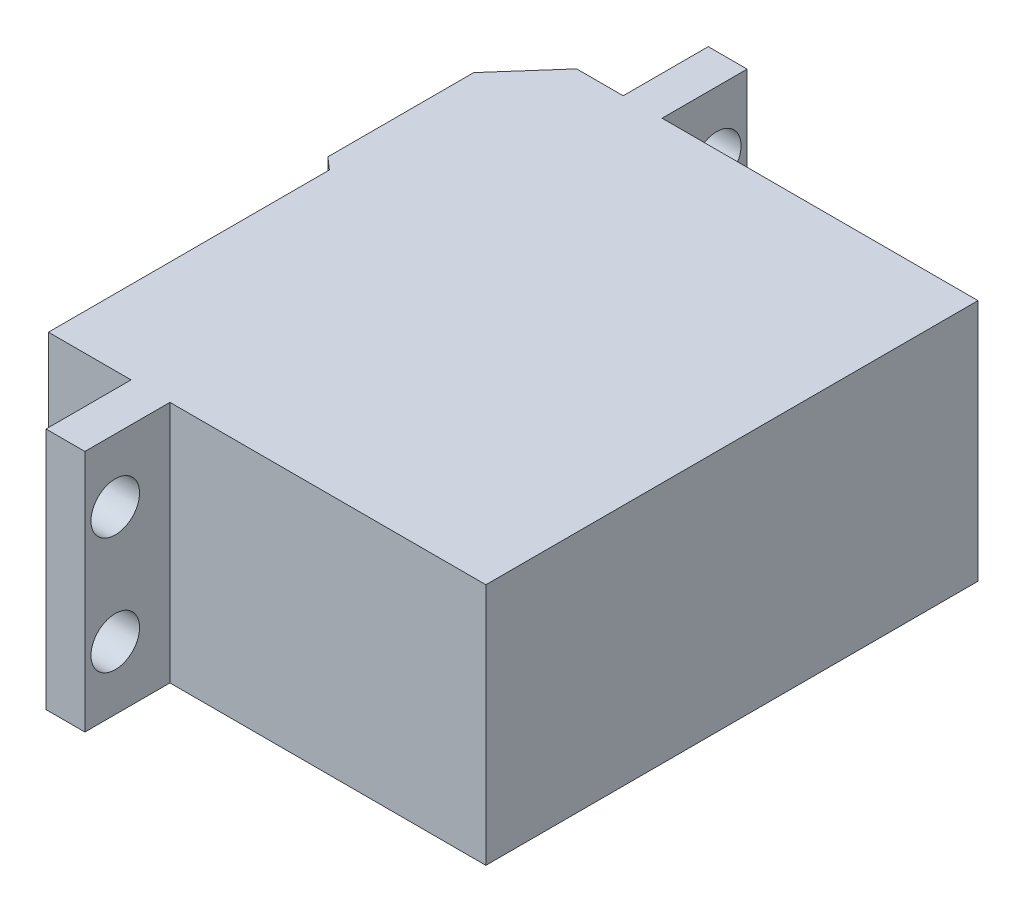
ISO-10303-21;
HEADER;
FILE_DESCRIPTION(('STEP AP214'),'2;1');
FILE_NAME('part.step','',(''),(''),'','','');
FILE_SCHEMA(('AUTOMOTIVE_DESIGN { 1 0 10303 214 1 1 1 1 }'));
ENDSEC;
DATA;
#1=APPLICATION_CONTEXT('core data for automotive mechanical design processes');
#2=APPLICATION_PROTOCOL_DEFINITION('international standard','automotive_design',2000,#1);
#3=PRODUCT_CONTEXT('',#1,'mechanical');
#4=PRODUCT('Part','Part','',(#3));
#5=PRODUCT_RELATED_PRODUCT_CATEGORY('part','',(#4));
#6=PRODUCT_DEFINITION_FORMATION('','',#4);
#7=PRODUCT_DEFINITION_CONTEXT('part definition',#1,'design');
#8=PRODUCT_DEFINITION('design','',#6,#7);
#9=PRODUCT_DEFINITION_SHAPE('','',#8);
#10=(LENGTH_UNIT() NAMED_UNIT(*) SI_UNIT(.MILLI.,.METRE.));
#11=(NAMED_UNIT(*) PLANE_ANGLE_UNIT() SI_UNIT($,.RADIAN.));
#12=(NAMED_UNIT(*) SI_UNIT($,.STERADIAN.) SOLID_ANGLE_UNIT());
#13=UNCERTAINTY_MEASURE_WITH_UNIT(LENGTH_MEASURE(1.E-05),#10,'distance_accuracy_value','');
#14=(GEOMETRIC_REPRESENTATION_CONTEXT(3) GLOBAL_UNCERTAINTY_ASSIGNED_CONTEXT((#13)) GLOBAL_UNIT_ASSIGNED_CONTEXT((#10,
#11,#12)) REPRESENTATION_CONTEXT('',''));
#15=CARTESIAN_POINT('',(0.,0.,0.));
#16=DIRECTION('',(0.,0.,1.));
#17=DIRECTION('',(1.,0.,0.));
#18=AXIS2_PLACEMENT_3D('',#15,#16,#17);
#19=CARTESIAN_POINT('',(-37.,20.,-36.));
#20=DIRECTION('',(1.,0.,0.));
#21=DIRECTION('',(0.,0.,-1.));
#22=AXIS2_PLACEMENT_3D('',#19,#20,#21);
#23=PLANE('',#22);
#24=DIRECTION('',(0.,0.,1.));
#25=VECTOR('',#24,1.);
#26=CARTESIAN_POINT('',(-37.,0.,-36.));
#27=LINE('',#26,#25);
#28=CARTESIAN_POINT('',(-37.,0.,-36.));
#29=VERTEX_POINT('',#28);
#30=CARTESIAN_POINT('',(-37.,0.,-24.));
#31=VERTEX_POINT('',#30);
#32=EDGE_CURVE('E287',#29,#31,#27,.T.);
#33=ORIENTED_EDGE('',*,*,#32,.T.);
#34=DIRECTION('',(0.,-1.,0.));
#35=VECTOR('',#34,1.);
#36=CARTESIAN_POINT('',(-37.,20.,-24.));
#37=LINE('',#36,#35);
#38=CARTESIAN_POINT('',(-37.,20.,-24.));
#39=VERTEX_POINT('',#38);
#40=EDGE_CURVE('E330',#39,#31,#37,.T.);
#41=ORIENTED_EDGE('',*,*,#40,.F.);
#42=DIRECTION('',(0.,0.,1.));
#43=VECTOR('',#42,1.);
#44=CARTESIAN_POINT('',(-37.,20.,-36.));
#45=LINE('',#44,#43);
#46=CARTESIAN_POINT('',(-37.,20.,-36.));
#47=VERTEX_POINT('',#46);
#48=EDGE_CURVE('E245',#47,#39,#45,.T.);
#49=ORIENTED_EDGE('',*,*,#48,.F.);
#50=DIRECTION('',(0.,-1.,0.));
#51=VECTOR('',#50,1.);
#52=CARTESIAN_POINT('',(-37.,20.,-36.));
#53=LINE('',#52,#51);
#54=EDGE_CURVE('E334',#47,#29,#53,.T.);
#55=ORIENTED_EDGE('',*,*,#54,.T.);
#56=EDGE_LOOP('',(#33,#41,#49,#55));
#57=FACE_BOUND('',#56,.T.);
#58=DIRECTION('',(0.,-0.866025403784439,-0.499999999999999));
#59=VECTOR('',#58,1.);
#60=CARTESIAN_POINT('',(-37.,13.,-31.7320508075689));
#61=LINE('',#60,#59);
#62=CARTESIAN_POINT('',(-37.,13.,-31.7320508075689));
#63=VERTEX_POINT('',#62);
#64=CARTESIAN_POINT('',(-37.,10.,-33.4641016151377));
#65=VERTEX_POINT('',#64);
#66=EDGE_CURVE('E57',#63,#65,#61,.T.);
#67=ORIENTED_EDGE('',*,*,#66,.F.);
#68=DIRECTION('',(0.,0.,-1.));
#69=VECTOR('',#68,1.);
#70=CARTESIAN_POINT('',(-37.,13.,-28.2679491924311));
#71=LINE('',#70,#69);
#72=CARTESIAN_POINT('',(-37.,13.,-28.2679491924311));
#73=VERTEX_POINT('',#72);
#74=EDGE_CURVE('E61',#73,#63,#71,.T.);
#75=ORIENTED_EDGE('',*,*,#74,.F.);
#76=DIRECTION('',(0.,0.866025403784439,-0.5));
#77=VECTOR('',#76,1.);
#78=CARTESIAN_POINT('',(-37.,10.,-26.5358983848622));
#79=LINE('',#78,#77);
#80=CARTESIAN_POINT('',(-37.,10.,-26.5358983848622));
#81=VERTEX_POINT('',#80);
#82=EDGE_CURVE('E414',#81,#73,#79,.T.);
#83=ORIENTED_EDGE('',*,*,#82,.F.);
#84=DIRECTION('',(0.,0.866025403784438,0.5));
#85=VECTOR('',#84,1.);
#86=CARTESIAN_POINT('',(-37.,7.,-28.2679491924311));
#87=LINE('',#86,#85);
#88=CARTESIAN_POINT('',(-37.,7.,-28.2679491924311));
#89=VERTEX_POINT('',#88);
#90=EDGE_CURVE('E410',#89,#81,#87,.T.);
#91=ORIENTED_EDGE('',*,*,#90,.F.);
#92=DIRECTION('',(0.,0.,1.));
#93=VECTOR('',#92,1.);
#94=CARTESIAN_POINT('',(-37.,7.,-31.7320508075689));
#95=LINE('',#94,#93);
#96=CARTESIAN_POINT('',(-37.,7.,-31.7320508075689));
#97=VERTEX_POINT('',#96);
#98=EDGE_CURVE('E406',#97,#89,#95,.T.);
#99=ORIENTED_EDGE('',*,*,#98,.F.);
#100=DIRECTION('',(0.,-0.866025403784439,0.5));
#101=VECTOR('',#100,1.);
#102=CARTESIAN_POINT('',(-37.,10.,-33.4641016151377));
#103=LINE('',#102,#101);
#104=EDGE_CURVE('E403',#65,#97,#103,.T.);
#105=ORIENTED_EDGE('',*,*,#104,.F.);
#106=EDGE_LOOP('',(#67,#75,#83,#91,#99,#105));
#107=FACE_BOUND('',#106,.T.);
#108=ADVANCED_FACE('F39',(#57,#107),#23,.F.);
#109=CARTESIAN_POINT('',(-26.,20.,0.));
#110=DIRECTION('',(0.,0.,-1.));
#111=DIRECTION('',(-1.,0.,0.));
#112=AXIS2_PLACEMENT_3D('',#109,#110,#111);
#113=PLANE('',#112);
#114=DIRECTION('',(1.,0.,0.));
#115=VECTOR('',#114,1.);
#116=CARTESIAN_POINT('',(-26.,0.,0.));
#117=LINE('',#116,#115);
#118=CARTESIAN_POINT('',(-26.,0.,0.));
#119=VERTEX_POINT('',#118);
#120=CARTESIAN_POINT('',(0.,0.,0.));
#121=VERTEX_POINT('',#120);
#122=EDGE_CURVE('E208',#119,#121,#117,.T.);
#123=ORIENTED_EDGE('',*,*,#122,.T.);
#124=DIRECTION('',(0.,-1.,0.));
#125=VECTOR('',#124,1.);
#126=CARTESIAN_POINT('',(0.,20.,0.));
#127=LINE('',#126,#125);
#128=CARTESIAN_POINT('',(0.,20.,0.));
#129=VERTEX_POINT('',#128);
#130=EDGE_CURVE('E11',#129,#121,#127,.T.);
#131=ORIENTED_EDGE('',*,*,#130,.F.);
#132=DIRECTION('',(1.,0.,0.));
#133=VECTOR('',#132,1.);
#134=CARTESIAN_POINT('',(-26.,20.,0.));
#135=LINE('',#134,#133);
#136=CARTESIAN_POINT('',(-26.,20.,0.));
#137=VERTEX_POINT('',#136);
#138=EDGE_CURVE('E219',#137,#129,#135,.T.);
#139=ORIENTED_EDGE('',*,*,#138,.F.);
#140=DIRECTION('',(0.,-1.,0.));
#141=VECTOR('',#140,1.);
#142=CARTESIAN_POINT('',(-26.,20.,0.));
#143=LINE('',#142,#141);
#144=EDGE_CURVE('E265',#137,#119,#143,.T.);
#145=ORIENTED_EDGE('',*,*,#144,.T.);
#146=EDGE_LOOP('',(#123,#131,#139,#145));
#147=FACE_BOUND('',#146,.T.);
#148=ADVANCED_FACE('F41',(#147),#113,.F.);
#149=CARTESIAN_POINT('',(0.,20.,0.));
#150=DIRECTION('',(-1.,0.,0.));
#151=DIRECTION('',(0.,0.,1.));
#152=AXIS2_PLACEMENT_3D('',#149,#150,#151);
#153=PLANE('',#152);
#154=DIRECTION('',(0.,0.,-1.));
#155=VECTOR('',#154,1.);
#156=CARTESIAN_POINT('',(0.,0.,0.));
#157=LINE('',#156,#155);
#158=CARTESIAN_POINT('',(0.,0.,-40.5));
#159=VERTEX_POINT('',#158);
#160=EDGE_CURVE('E213',#121,#159,#157,.T.);
#161=ORIENTED_EDGE('',*,*,#160,.T.);
#162=DIRECTION('',(0.,-1.,0.));
#163=VECTOR('',#162,1.);
#164=CARTESIAN_POINT('',(0.,20.,-40.5));
#165=LINE('',#164,#163);
#166=CARTESIAN_POINT('',(0.,20.,-40.5));
#167=VERTEX_POINT('',#166);
#168=EDGE_CURVE('E49',#167,#159,#165,.T.);
#169=ORIENTED_EDGE('',*,*,#168,.F.);
#170=DIRECTION('',(0.,0.,-1.));
#171=VECTOR('',#170,1.);
#172=CARTESIAN_POINT('',(0.,20.,0.));
#173=LINE('',#172,#171);
#174=EDGE_CURVE('E223',#129,#167,#173,.T.);
#175=ORIENTED_EDGE('',*,*,#174,.F.);
#176=ORIENTED_EDGE('',*,*,#130,.T.);
#177=EDGE_LOOP('',(#161,#169,#175,#176));
#178=FACE_BOUND('',#177,.T.);
#179=ADVANCED_FACE('F459',(#178),#153,.F.);
#180=CARTESIAN_POINT('',(0.,20.,-40.5));
#181=DIRECTION('',(0.,0.,1.));
#182=DIRECTION('',(1.,0.,0.));
#183=AXIS2_PLACEMENT_3D('',#180,#181,#182);
#184=PLANE('',#183);
#185=DIRECTION('',(-1.,0.,0.));
#186=VECTOR('',#185,1.);
#187=CARTESIAN_POINT('',(0.,0.,-40.5));
#188=LINE('',#187,#186);
#189=CARTESIAN_POINT('',(-26.,0.,-40.5));
#190=VERTEX_POINT('',#189);
#191=EDGE_CURVE('E269',#159,#190,#188,.T.);
#192=ORIENTED_EDGE('',*,*,#191,.T.);
#193=DIRECTION('',(0.,-1.,0.));
#194=VECTOR('',#193,1.);
#195=CARTESIAN_POINT('',(-26.,20.,-40.5));
#196=LINE('',#195,#194);
#197=CARTESIAN_POINT('',(-26.,20.,-40.5));
#198=VERTEX_POINT('',#197);
#199=EDGE_CURVE('E354',#198,#190,#196,.T.);
#200=ORIENTED_EDGE('',*,*,#199,.F.);
#201=DIRECTION('',(-1.,0.,0.));
#202=VECTOR('',#201,1.);
#203=CARTESIAN_POINT('',(0.,20.,-40.5));
#204=LINE('',#203,#202);
#205=EDGE_CURVE('E227',#167,#198,#204,.T.);
#206=ORIENTED_EDGE('',*,*,#205,.F.);
#207=ORIENTED_EDGE('',*,*,#168,.T.);
#208=EDGE_LOOP('',(#192,#200,#206,#207));
#209=FACE_BOUND('',#208,.T.);
#210=ADVANCED_FACE('F484',(#209),#184,.F.);
#211=CARTESIAN_POINT('',(-26.,20.,-40.5));
#212=DIRECTION('',(-1.,0.,0.));
#213=DIRECTION('',(0.,0.,1.));
#214=AXIS2_PLACEMENT_3D('',#211,#212,#213);
#215=PLANE('',#214);
#216=CARTESIAN_POINT('',(-26.,14.8,-45.));
#217=DIRECTION('',(-1.,0.,0.));
#218=DIRECTION('',(0.,0.,1.));
#219=AXIS2_PLACEMENT_3D('',#216,#217,#218);
#220=CIRCLE('',#219,2.);
#221=CARTESIAN_POINT('',(-26.,14.8,-43.));
#222=VERTEX_POINT('',#221);
#223=EDGE_CURVE('E386',#222,#222,#220,.T.);
#224=ORIENTED_EDGE('',*,*,#223,.T.);
#225=EDGE_LOOP('',(#224));
#226=FACE_BOUND('',#225,.T.);
#227=CARTESIAN_POINT('',(-26.,5.2,-45.));
#228=DIRECTION('',(-1.,0.,0.));
#229=DIRECTION('',(0.,0.,1.));
#230=AXIS2_PLACEMENT_3D('',#227,#228,#229);
#231=CIRCLE('',#230,2.);
#232=CARTESIAN_POINT('',(-26.,5.2,-43.));
#233=VERTEX_POINT('',#232);
#234=EDGE_CURVE('E369',#233,#233,#231,.T.);
#235=ORIENTED_EDGE('',*,*,#234,.T.);
#236=EDGE_LOOP('',(#235));
#237=FACE_BOUND('',#236,.T.);
#238=DIRECTION('',(0.,0.,-1.));
#239=VECTOR('',#238,1.);
#240=CARTESIAN_POINT('',(-26.,0.,-40.5));
#241=LINE('',#240,#239);
#242=CARTESIAN_POINT('',(-26.,0.,-47.5));
#243=VERTEX_POINT('',#242);
#244=EDGE_CURVE('E272',#190,#243,#241,.T.);
#245=ORIENTED_EDGE('',*,*,#244,.T.);
#246=DIRECTION('',(0.,-1.,0.));
#247=VECTOR('',#246,1.);
#248=CARTESIAN_POINT('',(-26.,20.,-47.5));
#249=LINE('',#248,#247);
#250=CARTESIAN_POINT('',(-26.,20.,-47.5));
#251=VERTEX_POINT('',#250);
#252=EDGE_CURVE('E350',#251,#243,#249,.T.);
#253=ORIENTED_EDGE('',*,*,#252,.F.);
#254=DIRECTION('',(0.,0.,-1.));
#255=VECTOR('',#254,1.);
#256=CARTESIAN_POINT('',(-26.,20.,-40.5));
#257=LINE('',#256,#255);
#258=EDGE_CURVE('E230',#198,#251,#257,.T.);
#259=ORIENTED_EDGE('',*,*,#258,.F.);
#260=ORIENTED_EDGE('',*,*,#199,.T.);
#261=EDGE_LOOP('',(#245,#253,#259,#260));
#262=FACE_BOUND('',#261,.T.);
#263=ADVANCED_FACE('F480',(#226,#237,#262),#215,.F.);
#264=CARTESIAN_POINT('',(-26.,20.,-47.5));
#265=DIRECTION('',(0.,0.,1.));
#266=DIRECTION('',(1.,0.,0.));
#267=AXIS2_PLACEMENT_3D('',#264,#265,#266);
#268=PLANE('',#267);
#269=DIRECTION('',(-1.,0.,0.));
#270=VECTOR('',#269,1.);
#271=CARTESIAN_POINT('',(-26.,0.,-47.5));
#272=LINE('',#271,#270);
#273=CARTESIAN_POINT('',(-29.2,0.,-47.5));
#274=VERTEX_POINT('',#273);
#275=EDGE_CURVE('E275',#243,#274,#272,.T.);
#276=ORIENTED_EDGE('',*,*,#275,.T.);
#277=DIRECTION('',(0.,-1.,0.));
#278=VECTOR('',#277,1.);
#279=CARTESIAN_POINT('',(-29.2,20.,-47.5));
#280=LINE('',#279,#278);
#281=CARTESIAN_POINT('',(-29.2,20.,-47.5));
#282=VERTEX_POINT('',#281);
#283=EDGE_CURVE('E346',#282,#274,#280,.T.);
#284=ORIENTED_EDGE('',*,*,#283,.F.);
#285=DIRECTION('',(-1.,0.,0.));
#286=VECTOR('',#285,1.);
#287=CARTESIAN_POINT('',(-26.,20.,-47.5));
#288=LINE('',#287,#286);
#289=EDGE_CURVE('E233',#251,#282,#288,.T.);
#290=ORIENTED_EDGE('',*,*,#289,.F.);
#291=ORIENTED_EDGE('',*,*,#252,.T.);
#292=EDGE_LOOP('',(#276,#284,#290,#291));
#293=FACE_BOUND('',#292,.T.);
#294=ADVANCED_FACE('F476',(#293),#268,.F.);
#295=CARTESIAN_POINT('',(-29.2,20.,-47.5));
#296=DIRECTION('',(1.,0.,0.));
#297=DIRECTION('',(0.,0.,-1.));
#298=AXIS2_PLACEMENT_3D('',#295,#296,#297);
#299=PLANE('',#298);
#300=CARTESIAN_POINT('',(-29.2,14.8,-45.));
#301=DIRECTION('',(-1.,0.,0.));
#302=DIRECTION('',(0.,0.,-1.));
#303=AXIS2_PLACEMENT_3D('',#300,#301,#302);
#304=CIRCLE('',#303,2.);
#305=CARTESIAN_POINT('',(-29.2,14.8,-47.));
#306=VERTEX_POINT('',#305);
#307=EDGE_CURVE('E371',#306,#306,#304,.T.);
#308=ORIENTED_EDGE('',*,*,#307,.F.);
#309=EDGE_LOOP('',(#308));
#310=FACE_BOUND('',#309,.T.);
#311=CARTESIAN_POINT('',(-29.2,5.2,-45.));
#312=DIRECTION('',(-1.,0.,0.));
#313=DIRECTION('',(0.,0.,1.));
#314=AXIS2_PLACEMENT_3D('',#311,#312,#313);
#315=CIRCLE('',#314,2.);
#316=CARTESIAN_POINT('',(-29.2,5.2,-43.));
#317=VERTEX_POINT('',#316);
#318=EDGE_CURVE('E363',#317,#317,#315,.T.);
#319=ORIENTED_EDGE('',*,*,#318,.F.);
#320=EDGE_LOOP('',(#319));
#321=FACE_BOUND('',#320,.T.);
#322=DIRECTION('',(0.,0.,1.));
#323=VECTOR('',#322,1.);
#324=CARTESIAN_POINT('',(-29.2,0.,-47.5));
#325=LINE('',#324,#323);
#326=CARTESIAN_POINT('',(-29.2,0.,-40.5));
#327=VERTEX_POINT('',#326);
#328=EDGE_CURVE('E278',#274,#327,#325,.T.);
#329=ORIENTED_EDGE('',*,*,#328,.T.);
#330=DIRECTION('',(0.,-1.,0.));
#331=VECTOR('',#330,1.);
#332=CARTESIAN_POINT('',(-29.2,20.,-40.5));
#333=LINE('',#332,#331);
#334=CARTESIAN_POINT('',(-29.2,20.,-40.5));
#335=VERTEX_POINT('',#334);
#336=EDGE_CURVE('E342',#335,#327,#333,.T.);
#337=ORIENTED_EDGE('',*,*,#336,.F.);
#338=DIRECTION('',(0.,0.,1.));
#339=VECTOR('',#338,1.);
#340=CARTESIAN_POINT('',(-29.2,20.,-47.5));
#341=LINE('',#340,#339);
#342=EDGE_CURVE('E236',#282,#335,#341,.T.);
#343=ORIENTED_EDGE('',*,*,#342,.F.);
#344=ORIENTED_EDGE('',*,*,#283,.T.);
#345=EDGE_LOOP('',(#329,#337,#343,#344));
#346=FACE_BOUND('',#345,.T.);
#347=ADVANCED_FACE('F472',(#310,#321,#346),#299,.F.);
#348=CARTESIAN_POINT('',(-29.2,20.,-40.5));
#349=DIRECTION('',(0.,0.,1.));
#350=DIRECTION('',(1.,0.,0.));
#351=AXIS2_PLACEMENT_3D('',#348,#349,#350);
#352=PLANE('',#351);
#353=DIRECTION('',(-1.,0.,0.));
#354=VECTOR('',#353,1.);
#355=CARTESIAN_POINT('',(-29.2,0.,-40.5));
#356=LINE('',#355,#354);
#357=CARTESIAN_POINT('',(-33.0313730334031,0.,-40.5));
#358=VERTEX_POINT('',#357);
#359=EDGE_CURVE('E281',#327,#358,#356,.T.);
#360=ORIENTED_EDGE('',*,*,#359,.T.);
#361=DIRECTION('',(0.,-1.,0.));
#362=VECTOR('',#361,1.);
#363=CARTESIAN_POINT('',(-33.0313730334031,20.,-40.5));
#364=LINE('',#363,#362);
#365=CARTESIAN_POINT('',(-33.0313730334031,20.,-40.5));
#366=VERTEX_POINT('',#365);
#367=EDGE_CURVE('E338',#366,#358,#364,.T.);
#368=ORIENTED_EDGE('',*,*,#367,.F.);
#369=DIRECTION('',(-1.,0.,0.));
#370=VECTOR('',#369,1.);
#371=CARTESIAN_POINT('',(-29.2,20.,-40.5));
#372=LINE('',#371,#370);
#373=EDGE_CURVE('E239',#335,#366,#372,.T.);
#374=ORIENTED_EDGE('',*,*,#373,.F.);
#375=ORIENTED_EDGE('',*,*,#336,.T.);
#376=EDGE_LOOP('',(#360,#368,#374,#375));
#377=FACE_BOUND('',#376,.T.);
#378=ADVANCED_FACE('F468',(#377),#352,.F.);
#379=CARTESIAN_POINT('',(-33.0313730334031,20.,-40.5));
#380=DIRECTION('',(0.749999999999998,0.,0.661437827766149));
#381=DIRECTION('',(0.661437827766149,0.,-0.749999999999999));
#382=AXIS2_PLACEMENT_3D('',#379,#380,#381);
#383=PLANE('',#382);
#384=DIRECTION('',(-0.661437827766149,0.,0.749999999999998));
#385=VECTOR('',#384,1.);
#386=CARTESIAN_POINT('',(-33.0313730334031,0.,-40.5));
#387=LINE('',#386,#385);
#388=EDGE_CURVE('E284',#358,#29,#387,.T.);
#389=ORIENTED_EDGE('',*,*,#388,.T.);
#390=ORIENTED_EDGE('',*,*,#54,.F.);
#391=DIRECTION('',(-0.661437827766149,0.,0.749999999999998));
#392=VECTOR('',#391,1.);
#393=CARTESIAN_POINT('',(-33.0313730334031,20.,-40.5));
#394=LINE('',#393,#392);
#395=EDGE_CURVE('E242',#366,#47,#394,.T.);
#396=ORIENTED_EDGE('',*,*,#395,.F.);
#397=ORIENTED_EDGE('',*,*,#367,.T.);
#398=EDGE_LOOP('',(#389,#390,#396,#397));
#399=FACE_BOUND('',#398,.T.);
#400=ADVANCED_FACE('F465',(#399),#383,.F.);
#401=CARTESIAN_POINT('',(-37.,20.,-24.));
#402=DIRECTION('',(0.661437827766149,0.,-0.749999999999999));
#403=DIRECTION('',(-0.749999999999999,0.,-0.661437827766149));
#404=AXIS2_PLACEMENT_3D('',#401,#402,#403);
#405=PLANE('',#404);
#406=DIRECTION('',(0.749999999999999,0.,0.661437827766148));
#407=VECTOR('',#406,1.);
#408=CARTESIAN_POINT('',(-37.,0.,-24.));
#409=LINE('',#408,#407);
#410=CARTESIAN_POINT('',(-36.,0.,-23.1180828963118));
#411=VERTEX_POINT('',#410);
#412=EDGE_CURVE('E290',#31,#411,#409,.T.);
#413=ORIENTED_EDGE('',*,*,#412,.T.);
#414=DIRECTION('',(0.,-1.,0.));
#415=VECTOR('',#414,1.);
#416=CARTESIAN_POINT('',(-36.,20.,-23.1180828963118));
#417=LINE('',#416,#415);
#418=CARTESIAN_POINT('',(-36.,20.,-23.1180828963118));
#419=VERTEX_POINT('',#418);
#420=EDGE_CURVE('E326',#419,#411,#417,.T.);
#421=ORIENTED_EDGE('',*,*,#420,.F.);
#422=DIRECTION('',(0.749999999999999,0.,0.661437827766148));
#423=VECTOR('',#422,1.);
#424=CARTESIAN_POINT('',(-37.,20.,-24.));
#425=LINE('',#424,#423);
#426=EDGE_CURVE('E248',#39,#419,#425,.T.);
#427=ORIENTED_EDGE('',*,*,#426,.F.);
#428=ORIENTED_EDGE('',*,*,#40,.T.);
#429=EDGE_LOOP('',(#413,#421,#427,#428));
#430=FACE_BOUND('',#429,.T.);
#431=ADVANCED_FACE('F463',(#430),#405,.F.);
#432=CARTESIAN_POINT('',(-36.,20.,-23.1180828963118));
#433=DIRECTION('',(1.,0.,0.));
#434=DIRECTION('',(0.,0.,-1.));
#435=AXIS2_PLACEMENT_3D('',#432,#433,#434);
#436=PLANE('',#435);
#437=DIRECTION('',(0.,0.,1.));
#438=VECTOR('',#437,1.);
#439=CARTESIAN_POINT('',(-36.,0.,-23.1180828963118));
#440=LINE('',#439,#438);
#441=CARTESIAN_POINT('',(-36.,0.,0.));
#442=VERTEX_POINT('',#441);
#443=EDGE_CURVE('E293',#411,#442,#440,.T.);
#444=ORIENTED_EDGE('',*,*,#443,.T.);
#445=DIRECTION('',(0.,-1.,0.));
#446=VECTOR('',#445,1.);
#447=CARTESIAN_POINT('',(-36.,20.,0.));
#448=LINE('',#447,#446);
#449=CARTESIAN_POINT('',(-36.,20.,0.));
#450=VERTEX_POINT('',#449);
#451=EDGE_CURVE('E322',#450,#442,#448,.T.);
#452=ORIENTED_EDGE('',*,*,#451,.F.);
#453=DIRECTION('',(0.,0.,1.));
#454=VECTOR('',#453,1.);
#455=CARTESIAN_POINT('',(-36.,20.,-23.1180828963118));
#456=LINE('',#455,#454);
#457=EDGE_CURVE('E251',#419,#450,#456,.T.);
#458=ORIENTED_EDGE('',*,*,#457,.F.);
#459=ORIENTED_EDGE('',*,*,#420,.T.);
#460=EDGE_LOOP('',(#444,#452,#458,#459));
#461=FACE_BOUND('',#460,.T.);
#462=ADVANCED_FACE('F538',(#461),#436,.F.);
#463=CARTESIAN_POINT('',(-36.,20.,0.));
#464=DIRECTION('',(0.,0.,-1.));
#465=DIRECTION('',(-1.,0.,0.));
#466=AXIS2_PLACEMENT_3D('',#463,#464,#465);
#467=PLANE('',#466);
#468=DIRECTION('',(1.,0.,0.));
#469=VECTOR('',#468,1.);
#470=CARTESIAN_POINT('',(-36.,0.,0.));
#471=LINE('',#470,#469);
#472=CARTESIAN_POINT('',(-29.2,0.,0.));
#473=VERTEX_POINT('',#472);
#474=EDGE_CURVE('E296',#442,#473,#471,.T.);
#475=ORIENTED_EDGE('',*,*,#474,.T.);
#476=DIRECTION('',(0.,-1.,0.));
#477=VECTOR('',#476,1.);
#478=CARTESIAN_POINT('',(-29.2,20.,0.));
#479=LINE('',#478,#477);
#480=CARTESIAN_POINT('',(-29.2,20.,0.));
#481=VERTEX_POINT('',#480);
#482=EDGE_CURVE('E318',#481,#473,#479,.T.);
#483=ORIENTED_EDGE('',*,*,#482,.F.);
#484=DIRECTION('',(1.,0.,0.));
#485=VECTOR('',#484,1.);
#486=CARTESIAN_POINT('',(-36.,20.,0.));
#487=LINE('',#486,#485);
#488=EDGE_CURVE('E254',#450,#481,#487,.T.);
#489=ORIENTED_EDGE('',*,*,#488,.F.);
#490=ORIENTED_EDGE('',*,*,#451,.T.);
#491=EDGE_LOOP('',(#475,#483,#489,#490));
#492=FACE_BOUND('',#491,.T.);
#493=ADVANCED_FACE('F533',(#492),#467,.F.);
#494=CARTESIAN_POINT('',(-29.2,20.,0.));
#495=DIRECTION('',(1.,0.,0.));
#496=DIRECTION('',(0.,0.,-1.));
#497=AXIS2_PLACEMENT_3D('',#494,#495,#496);
#498=PLANE('',#497);
#499=CARTESIAN_POINT('',(-29.2,5.2,4.50000000000001));
#500=DIRECTION('',(-1.,0.,0.));
#501=DIRECTION('',(0.,0.,-1.));
#502=AXIS2_PLACEMENT_3D('',#499,#500,#501);
#503=CIRCLE('',#502,2.);
#504=CARTESIAN_POINT('',(-29.2,5.2,2.50000000000001));
#505=VERTEX_POINT('',#504);
#506=EDGE_CURVE('E381',#505,#505,#503,.T.);
#507=ORIENTED_EDGE('',*,*,#506,.F.);
#508=EDGE_LOOP('',(#507));
#509=FACE_BOUND('',#508,.T.);
#510=CARTESIAN_POINT('',(-29.2,14.8,4.50000000000001));
#511=DIRECTION('',(-1.,0.,0.));
#512=DIRECTION('',(0.,0.,1.));
#513=AXIS2_PLACEMENT_3D('',#510,#511,#512);
#514=CIRCLE('',#513,2.);
#515=CARTESIAN_POINT('',(-29.2,14.8,6.50000000000001));
#516=VERTEX_POINT('',#515);
#517=EDGE_CURVE('E377',#516,#516,#514,.T.);
#518=ORIENTED_EDGE('',*,*,#517,.F.);
#519=EDGE_LOOP('',(#518));
#520=FACE_BOUND('',#519,.T.);
#521=DIRECTION('',(0.,0.,1.));
#522=VECTOR('',#521,1.);
#523=CARTESIAN_POINT('',(-29.2,0.,0.));
#524=LINE('',#523,#522);
#525=CARTESIAN_POINT('',(-29.2,0.,7.));
#526=VERTEX_POINT('',#525);
#527=EDGE_CURVE('E299',#473,#526,#524,.T.);
#528=ORIENTED_EDGE('',*,*,#527,.T.);
#529=DIRECTION('',(0.,-1.,0.));
#530=VECTOR('',#529,1.);
#531=CARTESIAN_POINT('',(-29.2,20.,7.));
#532=LINE('',#531,#530);
#533=CARTESIAN_POINT('',(-29.2,20.,7.));
#534=VERTEX_POINT('',#533);
#535=EDGE_CURVE('E314',#534,#526,#532,.T.);
#536=ORIENTED_EDGE('',*,*,#535,.F.);
#537=DIRECTION('',(0.,0.,1.));
#538=VECTOR('',#537,1.);
#539=CARTESIAN_POINT('',(-29.2,20.,0.));
#540=LINE('',#539,#538);
#541=EDGE_CURVE('E257',#481,#534,#540,.T.);
#542=ORIENTED_EDGE('',*,*,#541,.F.);
#543=ORIENTED_EDGE('',*,*,#482,.T.);
#544=EDGE_LOOP('',(#528,#536,#542,#543));
#545=FACE_BOUND('',#544,.T.);
#546=ADVANCED_FACE('F527',(#509,#520,#545),#498,.F.);
#547=CARTESIAN_POINT('',(-29.2,20.,7.));
#548=DIRECTION('',(0.,0.,-1.));
#549=DIRECTION('',(-1.,0.,0.));
#550=AXIS2_PLACEMENT_3D('',#547,#548,#549);
#551=PLANE('',#550);
#552=DIRECTION('',(1.,0.,0.));
#553=VECTOR('',#552,1.);
#554=CARTESIAN_POINT('',(-29.2,0.,7.));
#555=LINE('',#554,#553);
#556=CARTESIAN_POINT('',(-26.,0.,7.));
#557=VERTEX_POINT('',#556);
#558=EDGE_CURVE('E302',#526,#557,#555,.T.);
#559=ORIENTED_EDGE('',*,*,#558,.T.);
#560=DIRECTION('',(0.,-1.,0.));
#561=VECTOR('',#560,1.);
#562=CARTESIAN_POINT('',(-26.,20.,7.));
#563=LINE('',#562,#561);
#564=CARTESIAN_POINT('',(-26.,20.,7.));
#565=VERTEX_POINT('',#564);
#566=EDGE_CURVE('E310',#565,#557,#563,.T.);
#567=ORIENTED_EDGE('',*,*,#566,.F.);
#568=DIRECTION('',(1.,0.,0.));
#569=VECTOR('',#568,1.);
#570=CARTESIAN_POINT('',(-29.2,20.,7.));
#571=LINE('',#570,#569);
#572=EDGE_CURVE('E260',#534,#565,#571,.T.);
#573=ORIENTED_EDGE('',*,*,#572,.F.);
#574=ORIENTED_EDGE('',*,*,#535,.T.);
#575=EDGE_LOOP('',(#559,#567,#573,#574));
#576=FACE_BOUND('',#575,.T.);
#577=ADVANCED_FACE('F523',(#576),#551,.F.);
#578=CARTESIAN_POINT('',(-26.,20.,7.));
#579=DIRECTION('',(-1.,0.,0.));
#580=DIRECTION('',(0.,0.,1.));
#581=AXIS2_PLACEMENT_3D('',#578,#579,#580);
#582=PLANE('',#581);
#583=CARTESIAN_POINT('',(-26.,5.2,4.50000000000001));
#584=DIRECTION('',(-1.,0.,0.));
#585=DIRECTION('',(0.,0.,1.));
#586=AXIS2_PLACEMENT_3D('',#583,#584,#585);
#587=CIRCLE('',#586,2.);
#588=CARTESIAN_POINT('',(-26.,5.2,6.50000000000002));
#589=VERTEX_POINT('',#588);
#590=EDGE_CURVE('E43',#589,#589,#587,.T.);
#591=ORIENTED_EDGE('',*,*,#590,.T.);
#592=EDGE_LOOP('',(#591));
#593=FACE_BOUND('',#592,.T.);
#594=CARTESIAN_POINT('',(-26.,14.8,4.50000000000001));
#595=DIRECTION('',(-1.,0.,0.));
#596=DIRECTION('',(0.,0.,1.));
#597=AXIS2_PLACEMENT_3D('',#594,#595,#596);
#598=CIRCLE('',#597,2.);
#599=CARTESIAN_POINT('',(-26.,14.8,6.50000000000002));
#600=VERTEX_POINT('',#599);
#601=EDGE_CURVE('E360',#600,#600,#598,.T.);
#602=ORIENTED_EDGE('',*,*,#601,.T.);
#603=EDGE_LOOP('',(#602));
#604=FACE_BOUND('',#603,.T.);
#605=DIRECTION('',(0.,0.,-1.));
#606=VECTOR('',#605,1.);
#607=CARTESIAN_POINT('',(-26.,0.,7.));
#608=LINE('',#607,#606);
#609=EDGE_CURVE('E224',#557,#119,#608,.T.);
#610=ORIENTED_EDGE('',*,*,#609,.T.);
#611=ORIENTED_EDGE('',*,*,#144,.F.);
#612=DIRECTION('',(0.,0.,-1.));
#613=VECTOR('',#612,1.);
#614=CARTESIAN_POINT('',(-26.,20.,7.));
#615=LINE('',#614,#613);
#616=EDGE_CURVE('E263',#565,#137,#615,.T.);
#617=ORIENTED_EDGE('',*,*,#616,.F.);
#618=ORIENTED_EDGE('',*,*,#566,.T.);
#619=EDGE_LOOP('',(#610,#611,#617,#618));
#620=FACE_BOUND('',#619,.T.);
#621=ADVANCED_FACE('F519',(#593,#604,#620),#582,.F.);
#622=CARTESIAN_POINT('',(0.,20.,0.));
#623=DIRECTION('',(0.,1.,0.));
#624=DIRECTION('',(0.,0.,1.));
#625=AXIS2_PLACEMENT_3D('',#622,#623,#624);
#626=PLANE('',#625);
#627=ORIENTED_EDGE('',*,*,#138,.T.);
#628=ORIENTED_EDGE('',*,*,#174,.T.);
#629=ORIENTED_EDGE('',*,*,#205,.T.);
#630=ORIENTED_EDGE('',*,*,#258,.T.);
#631=ORIENTED_EDGE('',*,*,#289,.T.);
#632=ORIENTED_EDGE('',*,*,#342,.T.);
#633=ORIENTED_EDGE('',*,*,#373,.T.);
#634=ORIENTED_EDGE('',*,*,#395,.T.);
#635=ORIENTED_EDGE('',*,*,#48,.T.);
#636=ORIENTED_EDGE('',*,*,#426,.T.);
#637=ORIENTED_EDGE('',*,*,#457,.T.);
#638=ORIENTED_EDGE('',*,*,#488,.T.);
#639=ORIENTED_EDGE('',*,*,#541,.T.);
#640=ORIENTED_EDGE('',*,*,#572,.T.);
#641=ORIENTED_EDGE('',*,*,#616,.T.);
#642=EDGE_LOOP('',(#627,#628,#629,#630,#631,#632,#633,#634,#635,#636,#637,#638,#639,#640,#641));
#643=FACE_BOUND('',#642,.T.);
#644=ADVANCED_FACE('F510',(#643),#626,.T.);
#645=CARTESIAN_POINT('',(0.,0.,0.));
#646=DIRECTION('',(0.,1.,0.));
#647=DIRECTION('',(0.,0.,1.));
#648=AXIS2_PLACEMENT_3D('',#645,#646,#647);
#649=PLANE('',#648);
#650=ORIENTED_EDGE('',*,*,#122,.F.);
#651=ORIENTED_EDGE('',*,*,#609,.F.);
#652=ORIENTED_EDGE('',*,*,#558,.F.);
#653=ORIENTED_EDGE('',*,*,#527,.F.);
#654=ORIENTED_EDGE('',*,*,#474,.F.);
#655=ORIENTED_EDGE('',*,*,#443,.F.);
#656=ORIENTED_EDGE('',*,*,#412,.F.);
#657=ORIENTED_EDGE('',*,*,#32,.F.);
#658=ORIENTED_EDGE('',*,*,#388,.F.);
#659=ORIENTED_EDGE('',*,*,#359,.F.);
#660=ORIENTED_EDGE('',*,*,#328,.F.);
#661=ORIENTED_EDGE('',*,*,#275,.F.);
#662=ORIENTED_EDGE('',*,*,#244,.F.);
#663=ORIENTED_EDGE('',*,*,#191,.F.);
#664=ORIENTED_EDGE('',*,*,#160,.F.);
#665=EDGE_LOOP('',(#650,#651,#652,#653,#654,#655,#656,#657,#658,#659,#660,#661,#662,#663,#664));
#666=FACE_BOUND('',#665,.T.);
#667=ADVANCED_FACE('F500',(#666),#649,.F.);
#668=CARTESIAN_POINT('',(-41.,13.,-31.7320508075689));
#669=DIRECTION('',(0.,-0.499999999999999,0.866025403784439));
#670=DIRECTION('',(0.,-0.866025403784439,-0.499999999999999));
#671=AXIS2_PLACEMENT_3D('',#668,#669,#670);
#672=PLANE('',#671);
#673=ORIENTED_EDGE('',*,*,#66,.T.);
#674=DIRECTION('',(1.,0.,0.));
#675=VECTOR('',#674,1.);
#676=CARTESIAN_POINT('',(-41.,10.,-33.4641016151377));
#677=LINE('',#676,#675);
#678=CARTESIAN_POINT('',(-41.,10.,-33.4641016151377));
#679=VERTEX_POINT('',#678);
#680=EDGE_CURVE('E188',#679,#65,#677,.T.);
#681=ORIENTED_EDGE('',*,*,#680,.F.);
#682=DIRECTION('',(0.,-0.866025403784439,-0.499999999999999));
#683=VECTOR('',#682,1.);
#684=CARTESIAN_POINT('',(-41.,13.,-31.7320508075689));
#685=LINE('',#684,#683);
#686=CARTESIAN_POINT('',(-41.,13.,-31.7320508075689));
#687=VERTEX_POINT('',#686);
#688=EDGE_CURVE('E195',#687,#679,#685,.T.);
#689=ORIENTED_EDGE('',*,*,#688,.F.);
#690=DIRECTION('',(1.,0.,0.));
#691=VECTOR('',#690,1.);
#692=CARTESIAN_POINT('',(-41.,13.,-31.7320508075689));
#693=LINE('',#692,#691);
#694=EDGE_CURVE('E400',#687,#63,#693,.T.);
#695=ORIENTED_EDGE('',*,*,#694,.T.);
#696=EDGE_LOOP('',(#673,#681,#689,#695));
#697=FACE_BOUND('',#696,.T.);
#698=ADVANCED_FACE('F206',(#697),#672,.F.);
#699=CARTESIAN_POINT('',(-41.,10.,-33.4641016151377));
#700=DIRECTION('',(0.,0.5,0.866025403784439));
#701=DIRECTION('',(0.,-0.866025403784439,0.5));
#702=AXIS2_PLACEMENT_3D('',#699,#700,#701);
#703=PLANE('',#702);
#704=ORIENTED_EDGE('',*,*,#104,.T.);
#705=DIRECTION('',(1.,0.,0.));
#706=VECTOR('',#705,1.);
#707=CARTESIAN_POINT('',(-41.,7.,-31.7320508075689));
#708=LINE('',#707,#706);
#709=CARTESIAN_POINT('',(-41.,7.,-31.7320508075689));
#710=VERTEX_POINT('',#709);
#711=EDGE_CURVE('E190',#710,#97,#708,.T.);
#712=ORIENTED_EDGE('',*,*,#711,.F.);
#713=DIRECTION('',(0.,-0.866025403784439,0.5));
#714=VECTOR('',#713,1.);
#715=CARTESIAN_POINT('',(-41.,10.,-33.4641016151377));
#716=LINE('',#715,#714);
#717=EDGE_CURVE('E183',#679,#710,#716,.T.);
#718=ORIENTED_EDGE('',*,*,#717,.F.);
#719=ORIENTED_EDGE('',*,*,#680,.T.);
#720=EDGE_LOOP('',(#704,#712,#718,#719));
#721=FACE_BOUND('',#720,.T.);
#722=ADVANCED_FACE('F186',(#721),#703,.F.);
#723=CARTESIAN_POINT('',(-41.,7.,-31.7320508075689));
#724=DIRECTION('',(0.,1.,0.));
#725=DIRECTION('',(0.,0.,1.));
#726=AXIS2_PLACEMENT_3D('',#723,#724,#725);
#727=PLANE('',#726);
#728=ORIENTED_EDGE('',*,*,#98,.T.);
#729=DIRECTION('',(1.,0.,0.));
#730=VECTOR('',#729,1.);
#731=CARTESIAN_POINT('',(-41.,7.,-28.2679491924311));
#732=LINE('',#731,#730);
#733=CARTESIAN_POINT('',(-41.,7.,-28.2679491924311));
#734=VERTEX_POINT('',#733);
#735=EDGE_CURVE('E215',#734,#89,#732,.T.);
#736=ORIENTED_EDGE('',*,*,#735,.F.);
#737=DIRECTION('',(0.,0.,1.));
#738=VECTOR('',#737,1.);
#739=CARTESIAN_POINT('',(-41.,7.,-31.7320508075689));
#740=LINE('',#739,#738);
#741=EDGE_CURVE('E194',#710,#734,#740,.T.);
#742=ORIENTED_EDGE('',*,*,#741,.F.);
#743=ORIENTED_EDGE('',*,*,#711,.T.);
#744=EDGE_LOOP('',(#728,#736,#742,#743));
#745=FACE_BOUND('',#744,.T.);
#746=ADVANCED_FACE('F436',(#745),#727,.F.);
#747=CARTESIAN_POINT('',(-41.,7.,-28.2679491924311));
#748=DIRECTION('',(0.,0.5,-0.866025403784439));
#749=DIRECTION('',(0.,0.866025403784438,0.5));
#750=AXIS2_PLACEMENT_3D('',#747,#748,#749);
#751=PLANE('',#750);
#752=ORIENTED_EDGE('',*,*,#90,.T.);
#753=DIRECTION('',(1.,0.,0.));
#754=VECTOR('',#753,1.);
#755=CARTESIAN_POINT('',(-41.,10.,-26.5358983848622));
#756=LINE('',#755,#754);
#757=CARTESIAN_POINT('',(-41.,10.,-26.5358983848622));
#758=VERTEX_POINT('',#757);
#759=EDGE_CURVE('E425',#758,#81,#756,.T.);
#760=ORIENTED_EDGE('',*,*,#759,.F.);
#761=DIRECTION('',(0.,0.866025403784438,0.5));
#762=VECTOR('',#761,1.);
#763=CARTESIAN_POINT('',(-41.,7.,-28.2679491924311));
#764=LINE('',#763,#762);
#765=EDGE_CURVE('E392',#734,#758,#764,.T.);
#766=ORIENTED_EDGE('',*,*,#765,.F.);
#767=ORIENTED_EDGE('',*,*,#735,.T.);
#768=EDGE_LOOP('',(#752,#760,#766,#767));
#769=FACE_BOUND('',#768,.T.);
#770=ADVANCED_FACE('F433',(#769),#751,.F.);
#771=CARTESIAN_POINT('',(-41.,10.,-26.5358983848622));
#772=DIRECTION('',(0.,-0.5,-0.866025403784439));
#773=DIRECTION('',(0.,0.866025403784439,-0.5));
#774=AXIS2_PLACEMENT_3D('',#771,#772,#773);
#775=PLANE('',#774);
#776=ORIENTED_EDGE('',*,*,#82,.T.);
#777=DIRECTION('',(1.,0.,0.));
#778=VECTOR('',#777,1.);
#779=CARTESIAN_POINT('',(-41.,13.,-28.2679491924311));
#780=LINE('',#779,#778);
#781=CARTESIAN_POINT('',(-41.,13.,-28.2679491924311));
#782=VERTEX_POINT('',#781);
#783=EDGE_CURVE('E421',#782,#73,#780,.T.);
#784=ORIENTED_EDGE('',*,*,#783,.F.);
#785=DIRECTION('',(0.,0.866025403784439,-0.5));
#786=VECTOR('',#785,1.);
#787=CARTESIAN_POINT('',(-41.,10.,-26.5358983848622));
#788=LINE('',#787,#786);
#789=EDGE_CURVE('E395',#758,#782,#788,.T.);
#790=ORIENTED_EDGE('',*,*,#789,.F.);
#791=ORIENTED_EDGE('',*,*,#759,.T.);
#792=EDGE_LOOP('',(#776,#784,#790,#791));
#793=FACE_BOUND('',#792,.T.);
#794=ADVANCED_FACE('F439',(#793),#775,.F.);
#795=CARTESIAN_POINT('',(-41.,13.,-28.2679491924311));
#796=DIRECTION('',(0.,-1.,0.));
#797=DIRECTION('',(0.,0.,-1.));
#798=AXIS2_PLACEMENT_3D('',#795,#796,#797);
#799=PLANE('',#798);
#800=ORIENTED_EDGE('',*,*,#74,.T.);
#801=ORIENTED_EDGE('',*,*,#694,.F.);
#802=DIRECTION('',(0.,0.,-1.));
#803=VECTOR('',#802,1.);
#804=CARTESIAN_POINT('',(-41.,13.,-28.2679491924311));
#805=LINE('',#804,#803);
#806=EDGE_CURVE('E200',#782,#687,#805,.T.);
#807=ORIENTED_EDGE('',*,*,#806,.F.);
#808=ORIENTED_EDGE('',*,*,#783,.T.);
#809=EDGE_LOOP('',(#800,#801,#807,#808));
#810=FACE_BOUND('',#809,.T.);
#811=ADVANCED_FACE('F442',(#810),#799,.F.);
#812=CARTESIAN_POINT('',(-41.,0.,0.));
#813=DIRECTION('',(-1.,0.,0.));
#814=DIRECTION('',(0.,0.,1.));
#815=AXIS2_PLACEMENT_3D('',#812,#813,#814);
#816=PLANE('',#815);
#817=CARTESIAN_POINT('',(-41.,10.,-30.));
#818=DIRECTION('',(-1.,0.,0.));
#819=DIRECTION('',(0.,0.,1.));
#820=AXIS2_PLACEMENT_3D('',#817,#818,#819);
#821=CIRCLE('',#820,1.5);
#822=CARTESIAN_POINT('',(-41.,10.,-28.5));
#823=VERTEX_POINT('',#822);
#824=EDGE_CURVE('E694',#823,#823,#821,.T.);
#825=ORIENTED_EDGE('',*,*,#824,.F.);
#826=EDGE_LOOP('',(#825));
#827=FACE_BOUND('',#826,.T.);
#828=ORIENTED_EDGE('',*,*,#688,.T.);
#829=ORIENTED_EDGE('',*,*,#717,.T.);
#830=ORIENTED_EDGE('',*,*,#741,.T.);
#831=ORIENTED_EDGE('',*,*,#765,.T.);
#832=ORIENTED_EDGE('',*,*,#789,.T.);
#833=ORIENTED_EDGE('',*,*,#806,.T.);
#834=EDGE_LOOP('',(#828,#829,#830,#831,#832,#833));
#835=FACE_BOUND('',#834,.T.);
#836=ADVANCED_FACE('F198',(#827,#835),#816,.T.);
#837=CARTESIAN_POINT('',(0.,14.8,4.50000000000003));
#838=DIRECTION('',(-1.,0.,0.));
#839=DIRECTION('',(0.,0.,1.));
#840=AXIS2_PLACEMENT_3D('',#837,#838,#839);
#841=CYLINDRICAL_SURFACE('',#840,2.);
#842=ORIENTED_EDGE('',*,*,#517,.T.);
#843=EDGE_LOOP('',(#842));
#844=FACE_BOUND('',#843,.T.);
#845=ORIENTED_EDGE('',*,*,#601,.F.);
#846=EDGE_LOOP('',(#845));
#847=FACE_BOUND('',#846,.T.);
#848=ADVANCED_FACE('F449',(#844,#847),#841,.F.);
#849=CARTESIAN_POINT('',(0.,5.2,4.50000000000003));
#850=DIRECTION('',(-1.,0.,0.));
#851=DIRECTION('',(0.,0.,1.));
#852=AXIS2_PLACEMENT_3D('',#849,#850,#851);
#853=CYLINDRICAL_SURFACE('',#852,2.);
#854=ORIENTED_EDGE('',*,*,#506,.T.);
#855=EDGE_LOOP('',(#854));
#856=FACE_BOUND('',#855,.T.);
#857=ORIENTED_EDGE('',*,*,#590,.F.);
#858=EDGE_LOOP('',(#857));
#859=FACE_BOUND('',#858,.T.);
#860=ADVANCED_FACE('F632',(#856,#859),#853,.F.);
#861=CARTESIAN_POINT('',(0.,5.2,-45.));
#862=DIRECTION('',(-1.,0.,0.));
#863=DIRECTION('',(0.,0.,1.));
#864=AXIS2_PLACEMENT_3D('',#861,#862,#863);
#865=CYLINDRICAL_SURFACE('',#864,2.);
#866=ORIENTED_EDGE('',*,*,#318,.T.);
#867=EDGE_LOOP('',(#866));
#868=FACE_BOUND('',#867,.T.);
#869=ORIENTED_EDGE('',*,*,#234,.F.);
#870=EDGE_LOOP('',(#869));
#871=FACE_BOUND('',#870,.T.);
#872=ADVANCED_FACE('F642',(#868,#871),#865,.F.);
#873=CARTESIAN_POINT('',(0.,14.8,-45.));
#874=DIRECTION('',(-1.,0.,0.));
#875=DIRECTION('',(0.,0.,1.));
#876=AXIS2_PLACEMENT_3D('',#873,#874,#875);
#877=CYLINDRICAL_SURFACE('',#876,2.);
#878=ORIENTED_EDGE('',*,*,#307,.T.);
#879=EDGE_LOOP('',(#878));
#880=FACE_BOUND('',#879,.T.);
#881=ORIENTED_EDGE('',*,*,#223,.F.);
#882=EDGE_LOOP('',(#881));
#883=FACE_BOUND('',#882,.T.);
#884=ADVANCED_FACE('F652',(#880,#883),#877,.F.);
#885=CARTESIAN_POINT('',(-39.,10.,-30.));
#886=DIRECTION('',(-1.,0.,0.));
#887=DIRECTION('',(0.,0.,1.));
#888=AXIS2_PLACEMENT_3D('',#885,#886,#887);
#889=CYLINDRICAL_SURFACE('',#888,1.5);
#890=CARTESIAN_POINT('',(-39.,10.,-30.));
#891=DIRECTION('',(-1.,0.,0.));
#892=DIRECTION('',(0.,0.,1.));
#893=AXIS2_PLACEMENT_3D('',#890,#891,#892);
#894=CIRCLE('',#893,1.5);
#895=CARTESIAN_POINT('',(-39.,10.,-28.5));
#896=VERTEX_POINT('',#895);
#897=EDGE_CURVE('E692',#896,#896,#894,.T.);
#898=ORIENTED_EDGE('',*,*,#897,.F.);
#899=EDGE_LOOP('',(#898));
#900=FACE_BOUND('',#899,.T.);
#901=ORIENTED_EDGE('',*,*,#824,.T.);
#902=EDGE_LOOP('',(#901));
#903=FACE_BOUND('',#902,.T.);
#904=ADVANCED_FACE('F661',(#900,#903),#889,.F.);
#905=CARTESIAN_POINT('',(-39.,10.,-30.));
#906=DIRECTION('',(-1.,0.,0.));
#907=DIRECTION('',(0.,0.,1.));
#908=AXIS2_PLACEMENT_3D('',#905,#906,#907);
#909=PLANE('',#908);
#910=ORIENTED_EDGE('',*,*,#897,.T.);
#911=EDGE_LOOP('',(#910));
#912=FACE_BOUND('',#911,.T.);
#913=ADVANCED_FACE('F676',(#912),#909,.T.);
#914=CLOSED_SHELL('',(#108,#148,#179,#210,#263,#294,#347,#378,#400,#431,#462,#493,#546,#577,
#621,#644,#667,#698,#722,#746,#770,#794,#811,#836,#848,#860,#872,#884,#904,#913));
#915=MANIFOLD_SOLID_BREP('B2',#914);
#916=ADVANCED_BREP_SHAPE_REPRESENTATION('',(#18,#915),#14);
#917=SHAPE_DEFINITION_REPRESENTATION(#9,#916);
ENDSEC;
END-ISO-10303-21;
